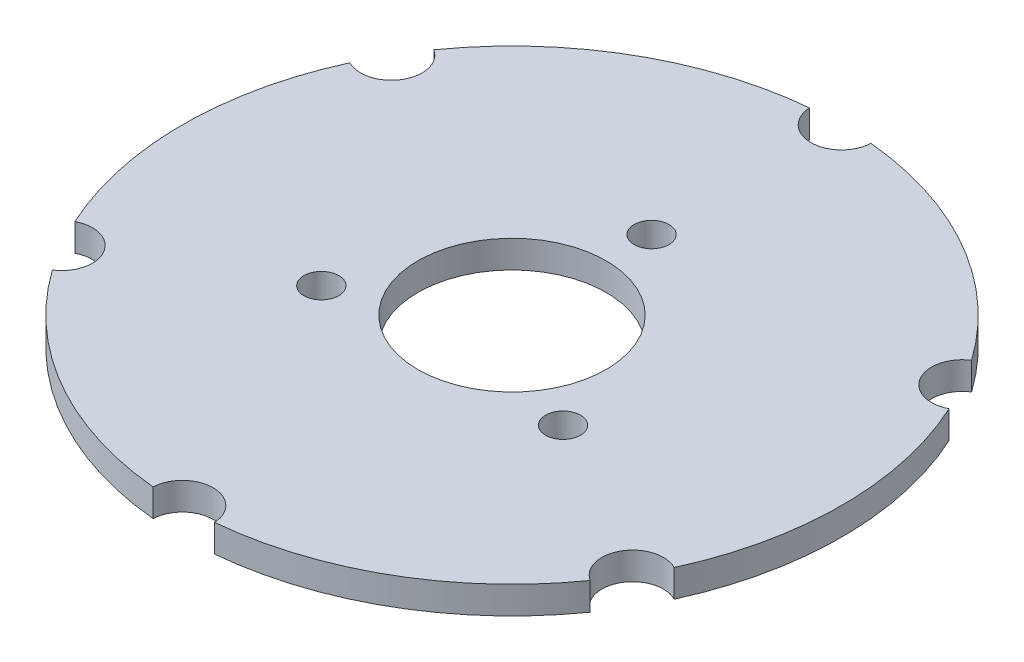
ISO-10303-21;
HEADER;
FILE_DESCRIPTION(('STEP AP214'),'2;1');
FILE_NAME('part.step','',(''),(''),'','','');
FILE_SCHEMA(('AUTOMOTIVE_DESIGN { 1 0 10303 214 1 1 1 1 }'));
ENDSEC;
DATA;
#1=APPLICATION_CONTEXT('core data for automotive mechanical design processes');
#2=APPLICATION_PROTOCOL_DEFINITION('international standard','automotive_design',2000,#1);
#3=PRODUCT_CONTEXT('',#1,'mechanical');
#4=PRODUCT('Part','Part','',(#3));
#5=PRODUCT_RELATED_PRODUCT_CATEGORY('part','',(#4));
#6=PRODUCT_DEFINITION_FORMATION('','',#4);
#7=PRODUCT_DEFINITION_CONTEXT('part definition',#1,'design');
#8=PRODUCT_DEFINITION('design','',#6,#7);
#9=PRODUCT_DEFINITION_SHAPE('','',#8);
#10=(LENGTH_UNIT() NAMED_UNIT(*) SI_UNIT(.MILLI.,.METRE.));
#11=(NAMED_UNIT(*) PLANE_ANGLE_UNIT() SI_UNIT($,.RADIAN.));
#12=(NAMED_UNIT(*) SI_UNIT($,.STERADIAN.) SOLID_ANGLE_UNIT());
#13=UNCERTAINTY_MEASURE_WITH_UNIT(LENGTH_MEASURE(1.E-05),#10,'distance_accuracy_value','');
#14=(GEOMETRIC_REPRESENTATION_CONTEXT(3) GLOBAL_UNCERTAINTY_ASSIGNED_CONTEXT((#13)) GLOBAL_UNIT_ASSIGNED_CONTEXT((#10,
#11,#12)) REPRESENTATION_CONTEXT('',''));
#15=CARTESIAN_POINT('',(0.,0.,0.));
#16=DIRECTION('',(0.,0.,1.));
#17=DIRECTION('',(1.,0.,0.));
#18=AXIS2_PLACEMENT_3D('',#15,#16,#17);
#19=CARTESIAN_POINT('',(0.,5.,0.));
#20=DIRECTION('',(0.,-1.,0.));
#21=DIRECTION('',(0.,0.,-1.));
#22=AXIS2_PLACEMENT_3D('',#19,#20,#21);
#23=CYLINDRICAL_SURFACE('',#22,59.99988);
#24=CARTESIAN_POINT('',(0.,0.,0.));
#25=DIRECTION('',(0.,1.,0.));
#26=DIRECTION('',(0.,0.,1.));
#27=AXIS2_PLACEMENT_3D('',#24,#25,#26);
#28=CIRCLE('',#27,59.99988);
#29=CARTESIAN_POINT('',(54.5318099850476,0.,25.0253331600013));
#30=VERTEX_POINT('',#29);
#31=CARTESIAN_POINT('',(54.5318099850471,0.,-25.0253331600024));
#32=VERTEX_POINT('',#31);
#33=EDGE_CURVE('E141',#30,#32,#28,.T.);
#34=ORIENTED_EDGE('',*,*,#33,.T.);
#35=DIRECTION('',(0.,1.,0.));
#36=VECTOR('',#35,1.);
#37=CARTESIAN_POINT('',(54.5318099850471,2.5,-25.0253331600024));
#38=LINE('',#37,#36);
#39=CARTESIAN_POINT('',(54.5318099850471,5.,-25.0253331600024));
#40=VERTEX_POINT('',#39);
#41=EDGE_CURVE('E50',#32,#40,#38,.T.);
#42=ORIENTED_EDGE('',*,*,#41,.T.);
#43=CARTESIAN_POINT('',(0.,5.,0.));
#44=DIRECTION('',(0.,1.,0.));
#45=DIRECTION('',(0.,0.,1.));
#46=AXIS2_PLACEMENT_3D('',#43,#44,#45);
#47=CIRCLE('',#46,59.99988);
#48=CARTESIAN_POINT('',(54.5318099850476,5.,25.0253331600013));
#49=VERTEX_POINT('',#48);
#50=EDGE_CURVE('E200',#49,#40,#47,.T.);
#51=ORIENTED_EDGE('',*,*,#50,.F.);
#52=DIRECTION('',(0.,1.,0.));
#53=VECTOR('',#52,1.);
#54=CARTESIAN_POINT('',(54.5318099850476,2.5,25.0253331600013));
#55=LINE('',#54,#53);
#56=EDGE_CURVE('E239',#49,#30,#55,.F.);
#57=ORIENTED_EDGE('',*,*,#56,.T.);
#58=EDGE_LOOP('',(#34,#42,#51,#57));
#59=FACE_BOUND('',#58,.T.);
#60=ADVANCED_FACE('F35',(#59),#23,.T.);
#61=CARTESIAN_POINT('',(5.59333073779304,0.,59.7385993413979));
#62=VERTEX_POINT('',#61);
#63=CARTESIAN_POINT('',(48.9384792472547,0.,34.7132661813956));
#64=VERTEX_POINT('',#63);
#65=EDGE_CURVE('E145',#62,#64,#28,.T.);
#66=ORIENTED_EDGE('',*,*,#65,.T.);
#67=DIRECTION('',(0.,1.,0.));
#68=VECTOR('',#67,1.);
#69=CARTESIAN_POINT('',(48.9384792472547,2.5,34.7132661813956));
#70=LINE('',#69,#68);
#71=CARTESIAN_POINT('',(48.9384792472547,5.,34.7132661813956));
#72=VERTEX_POINT('',#71);
#73=EDGE_CURVE('E57',#64,#72,#70,.T.);
#74=ORIENTED_EDGE('',*,*,#73,.T.);
#75=CARTESIAN_POINT('',(5.59333073779304,5.,59.7385993413979));
#76=VERTEX_POINT('',#75);
#77=EDGE_CURVE('E204',#76,#72,#47,.T.);
#78=ORIENTED_EDGE('',*,*,#77,.F.);
#79=DIRECTION('',(0.,1.,0.));
#80=VECTOR('',#79,1.);
#81=CARTESIAN_POINT('',(5.59333073779304,2.5,59.7385993413979));
#82=LINE('',#81,#80);
#83=EDGE_CURVE('E177',#76,#62,#82,.F.);
#84=ORIENTED_EDGE('',*,*,#83,.T.);
#85=EDGE_LOOP('',(#66,#74,#78,#84));
#86=FACE_BOUND('',#85,.T.);
#87=ADVANCED_FACE('F174',(#86),#23,.T.);
#88=CARTESIAN_POINT('',(-48.9384792472542,0.,34.7132661813963));
#89=VERTEX_POINT('',#88);
#90=CARTESIAN_POINT('',(-5.59333073779307,0.,59.7385993413979));
#91=VERTEX_POINT('',#90);
#92=EDGE_CURVE('E160',#89,#91,#28,.T.);
#93=ORIENTED_EDGE('',*,*,#92,.T.);
#94=DIRECTION('',(0.,1.,0.));
#95=VECTOR('',#94,1.);
#96=CARTESIAN_POINT('',(-5.59333073779304,2.5,59.7385993413979));
#97=LINE('',#96,#95);
#98=CARTESIAN_POINT('',(-5.59333073779304,5.,59.7385993413979));
#99=VERTEX_POINT('',#98);
#100=EDGE_CURVE('E233',#91,#99,#97,.T.);
#101=ORIENTED_EDGE('',*,*,#100,.T.);
#102=CARTESIAN_POINT('',(-48.9384792472542,5.,34.7132661813963));
#103=VERTEX_POINT('',#102);
#104=EDGE_CURVE('E197',#103,#99,#47,.T.);
#105=ORIENTED_EDGE('',*,*,#104,.F.);
#106=DIRECTION('',(0.,1.,0.));
#107=VECTOR('',#106,1.);
#108=CARTESIAN_POINT('',(-48.9384792472542,2.5,34.7132661813963));
#109=LINE('',#108,#107);
#110=EDGE_CURVE('E229',#103,#89,#109,.F.);
#111=ORIENTED_EDGE('',*,*,#110,.T.);
#112=EDGE_LOOP('',(#93,#101,#105,#111));
#113=FACE_BOUND('',#112,.T.);
#114=ADVANCED_FACE('F267',(#113),#23,.T.);
#115=CARTESIAN_POINT('',(-54.5318099850475,0.,-25.0253331600017));
#116=VERTEX_POINT('',#115);
#117=CARTESIAN_POINT('',(-54.5318099850473,0.,25.025333160002));
#118=VERTEX_POINT('',#117);
#119=EDGE_CURVE('E152',#116,#118,#28,.T.);
#120=ORIENTED_EDGE('',*,*,#119,.T.);
#121=DIRECTION('',(0.,1.,0.));
#122=VECTOR('',#121,1.);
#123=CARTESIAN_POINT('',(-54.5318099850473,2.5,25.025333160002));
#124=LINE('',#123,#122);
#125=CARTESIAN_POINT('',(-54.5318099850473,5.,25.025333160002));
#126=VERTEX_POINT('',#125);
#127=EDGE_CURVE('E227',#118,#126,#124,.T.);
#128=ORIENTED_EDGE('',*,*,#127,.T.);
#129=CARTESIAN_POINT('',(-54.5318099850475,5.,-25.0253331600017));
#130=VERTEX_POINT('',#129);
#131=EDGE_CURVE('E190',#130,#126,#47,.T.);
#132=ORIENTED_EDGE('',*,*,#131,.F.);
#133=DIRECTION('',(0.,1.,0.));
#134=VECTOR('',#133,1.);
#135=CARTESIAN_POINT('',(-54.5318099850475,2.5,-25.0253331600017));
#136=LINE('',#135,#134);
#137=EDGE_CURVE('E223',#130,#116,#136,.F.);
#138=ORIENTED_EDGE('',*,*,#137,.T.);
#139=EDGE_LOOP('',(#120,#128,#132,#138));
#140=FACE_BOUND('',#139,.T.);
#141=ADVANCED_FACE('F281',(#140),#23,.T.);
#142=CARTESIAN_POINT('',(-5.59333073779304,0.,-59.7385993413979));
#143=VERTEX_POINT('',#142);
#144=CARTESIAN_POINT('',(-48.9384792472544,0.,-34.713266181396));
#145=VERTEX_POINT('',#144);
#146=EDGE_CURVE('E144',#143,#145,#28,.T.);
#147=ORIENTED_EDGE('',*,*,#146,.T.);
#148=DIRECTION('',(0.,1.,0.));
#149=VECTOR('',#148,1.);
#150=CARTESIAN_POINT('',(-48.9384792472544,2.5,-34.7132661813959));
#151=LINE('',#150,#149);
#152=CARTESIAN_POINT('',(-48.9384792472544,5.,-34.7132661813959));
#153=VERTEX_POINT('',#152);
#154=EDGE_CURVE('E221',#145,#153,#151,.T.);
#155=ORIENTED_EDGE('',*,*,#154,.T.);
#156=CARTESIAN_POINT('',(-5.59333073779304,5.,-59.7385993413979));
#157=VERTEX_POINT('',#156);
#158=EDGE_CURVE('E188',#157,#153,#47,.T.);
#159=ORIENTED_EDGE('',*,*,#158,.F.);
#160=DIRECTION('',(0.,1.,0.));
#161=VECTOR('',#160,1.);
#162=CARTESIAN_POINT('',(-5.59333073779304,2.5,-59.7385993413979));
#163=LINE('',#162,#161);
#164=EDGE_CURVE('E217',#157,#143,#163,.F.);
#165=ORIENTED_EDGE('',*,*,#164,.T.);
#166=EDGE_LOOP('',(#147,#155,#159,#165));
#167=FACE_BOUND('',#166,.T.);
#168=ADVANCED_FACE('F271',(#167),#23,.T.);
#169=CARTESIAN_POINT('',(-21.9970452561248,5.,12.7));
#170=DIRECTION('',(0.,-1.,0.));
#171=DIRECTION('',(0.,0.,-1.));
#172=AXIS2_PLACEMENT_3D('',#169,#170,#171);
#173=CYLINDRICAL_SURFACE('',#172,3.175);
#174=CARTESIAN_POINT('',(-21.9970452561248,5.,12.7));
#175=DIRECTION('',(0.,1.,0.));
#176=DIRECTION('',(0.,0.,1.));
#177=AXIS2_PLACEMENT_3D('',#174,#175,#176);
#178=CIRCLE('',#177,3.175);
#179=CARTESIAN_POINT('',(-21.9970452561248,5.,15.875));
#180=VERTEX_POINT('',#179);
#181=EDGE_CURVE('E201',#180,#180,#178,.T.);
#182=ORIENTED_EDGE('',*,*,#181,.T.);
#183=EDGE_LOOP('',(#182));
#184=FACE_BOUND('',#183,.T.);
#185=CARTESIAN_POINT('',(-21.9970452561248,0.,12.7));
#186=DIRECTION('',(0.,1.,0.));
#187=DIRECTION('',(0.,0.,1.));
#188=AXIS2_PLACEMENT_3D('',#185,#186,#187);
#189=CIRCLE('',#188,3.175);
#190=CARTESIAN_POINT('',(-21.9970452561248,0.,15.875));
#191=VERTEX_POINT('',#190);
#192=EDGE_CURVE('E142',#191,#191,#189,.T.);
#193=ORIENTED_EDGE('',*,*,#192,.F.);
#194=EDGE_LOOP('',(#193));
#195=FACE_BOUND('',#194,.T.);
#196=ADVANCED_FACE('F280',(#184,#195),#173,.F.);
#197=CARTESIAN_POINT('',(0.,5.,-25.4));
#198=DIRECTION('',(0.,-1.,0.));
#199=DIRECTION('',(0.,0.,-1.));
#200=AXIS2_PLACEMENT_3D('',#197,#198,#199);
#201=CYLINDRICAL_SURFACE('',#200,3.175);
#202=CARTESIAN_POINT('',(0.,5.,-25.4));
#203=DIRECTION('',(0.,1.,0.));
#204=DIRECTION('',(0.,0.,1.));
#205=AXIS2_PLACEMENT_3D('',#202,#203,#204);
#206=CIRCLE('',#205,3.175);
#207=CARTESIAN_POINT('',(0.,5.,-22.225));
#208=VERTEX_POINT('',#207);
#209=EDGE_CURVE('E206',#208,#208,#206,.T.);
#210=ORIENTED_EDGE('',*,*,#209,.T.);
#211=EDGE_LOOP('',(#210));
#212=FACE_BOUND('',#211,.T.);
#213=CARTESIAN_POINT('',(0.,0.,-25.4));
#214=DIRECTION('',(0.,1.,0.));
#215=DIRECTION('',(0.,0.,1.));
#216=AXIS2_PLACEMENT_3D('',#213,#214,#215);
#217=CIRCLE('',#216,3.175);
#218=CARTESIAN_POINT('',(0.,0.,-22.225));
#219=VERTEX_POINT('',#218);
#220=EDGE_CURVE('E147',#219,#219,#217,.T.);
#221=ORIENTED_EDGE('',*,*,#220,.F.);
#222=EDGE_LOOP('',(#221));
#223=FACE_BOUND('',#222,.T.);
#224=ADVANCED_FACE('F286',(#212,#223),#201,.F.);
#225=CARTESIAN_POINT('',(21.9970452561248,5.,12.6999999999999));
#226=DIRECTION('',(0.,-1.,0.));
#227=DIRECTION('',(0.,0.,-1.));
#228=AXIS2_PLACEMENT_3D('',#225,#226,#227);
#229=CYLINDRICAL_SURFACE('',#228,3.175);
#230=CARTESIAN_POINT('',(21.9970452561248,5.,12.6999999999999));
#231=DIRECTION('',(0.,1.,0.));
#232=DIRECTION('',(0.,0.,1.));
#233=AXIS2_PLACEMENT_3D('',#230,#231,#232);
#234=CIRCLE('',#233,3.175);
#235=CARTESIAN_POINT('',(21.9970452561248,5.,15.8749999999999));
#236=VERTEX_POINT('',#235);
#237=EDGE_CURVE('E157',#236,#236,#234,.T.);
#238=ORIENTED_EDGE('',*,*,#237,.T.);
#239=EDGE_LOOP('',(#238));
#240=FACE_BOUND('',#239,.T.);
#241=CARTESIAN_POINT('',(21.9970452561248,0.,12.6999999999999));
#242=DIRECTION('',(0.,1.,0.));
#243=DIRECTION('',(0.,0.,1.));
#244=AXIS2_PLACEMENT_3D('',#241,#242,#243);
#245=CIRCLE('',#244,3.175);
#246=CARTESIAN_POINT('',(21.9970452561248,0.,15.8749999999999));
#247=VERTEX_POINT('',#246);
#248=EDGE_CURVE('E355',#247,#247,#245,.T.);
#249=ORIENTED_EDGE('',*,*,#248,.F.);
#250=EDGE_LOOP('',(#249));
#251=FACE_BOUND('',#250,.T.);
#252=ADVANCED_FACE('F277',(#240,#251),#229,.F.);
#253=CARTESIAN_POINT('',(0.,5.,0.));
#254=DIRECTION('',(0.,-1.,0.));
#255=DIRECTION('',(0.,0.,-1.));
#256=AXIS2_PLACEMENT_3D('',#253,#254,#255);
#257=CYLINDRICAL_SURFACE('',#256,17.145);
#258=CARTESIAN_POINT('',(0.,5.,0.));
#259=DIRECTION('',(0.,1.,0.));
#260=DIRECTION('',(0.,0.,1.));
#261=AXIS2_PLACEMENT_3D('',#258,#259,#260);
#262=CIRCLE('',#261,17.145);
#263=CARTESIAN_POINT('',(0.,5.,17.145));
#264=VERTEX_POINT('',#263);
#265=EDGE_CURVE('E151',#264,#264,#262,.T.);
#266=ORIENTED_EDGE('',*,*,#265,.T.);
#267=EDGE_LOOP('',(#266));
#268=FACE_BOUND('',#267,.T.);
#269=CARTESIAN_POINT('',(0.,0.,0.));
#270=DIRECTION('',(0.,1.,0.));
#271=DIRECTION('',(0.,0.,1.));
#272=AXIS2_PLACEMENT_3D('',#269,#270,#271);
#273=CIRCLE('',#272,17.145);
#274=CARTESIAN_POINT('',(0.,0.,17.145));
#275=VERTEX_POINT('',#274);
#276=EDGE_CURVE('E216',#275,#275,#273,.T.);
#277=ORIENTED_EDGE('',*,*,#276,.F.);
#278=EDGE_LOOP('',(#277));
#279=FACE_BOUND('',#278,.T.);
#280=ADVANCED_FACE('F37',(#268,#279),#257,.F.);
#281=CARTESIAN_POINT('',(48.938479247254,5.,-34.7132661813966));
#282=VERTEX_POINT('',#281);
#283=CARTESIAN_POINT('',(5.59333073779304,5.,-59.7385993413979));
#284=VERTEX_POINT('',#283);
#285=EDGE_CURVE('E134',#282,#284,#47,.T.);
#286=ORIENTED_EDGE('',*,*,#285,.F.);
#287=DIRECTION('',(0.,1.,0.));
#288=VECTOR('',#287,1.);
#289=CARTESIAN_POINT('',(48.938479247254,2.5,-34.7132661813966));
#290=LINE('',#289,#288);
#291=CARTESIAN_POINT('',(48.938479247254,0.,-34.7132661813966));
#292=VERTEX_POINT('',#291);
#293=EDGE_CURVE('E122',#282,#292,#290,.F.);
#294=ORIENTED_EDGE('',*,*,#293,.T.);
#295=CARTESIAN_POINT('',(5.59333073779307,0.,-59.7385993413979));
#296=VERTEX_POINT('',#295);
#297=EDGE_CURVE('E132',#292,#296,#28,.T.);
#298=ORIENTED_EDGE('',*,*,#297,.T.);
#299=DIRECTION('',(0.,1.,0.));
#300=VECTOR('',#299,1.);
#301=CARTESIAN_POINT('',(5.59333073779304,2.5,-59.7385993413979));
#302=LINE('',#301,#300);
#303=EDGE_CURVE('E214',#296,#284,#302,.T.);
#304=ORIENTED_EDGE('',*,*,#303,.T.);
#305=EDGE_LOOP('',(#286,#294,#298,#304));
#306=FACE_BOUND('',#305,.T.);
#307=ADVANCED_FACE('F130',(#306),#23,.T.);
#308=CARTESIAN_POINT('',(-132.141157356237,5.,0.));
#309=DIRECTION('',(0.,1.,0.));
#310=DIRECTION('',(0.,0.,1.));
#311=AXIS2_PLACEMENT_3D('',#308,#309,#310);
#312=PLANE('',#311);
#313=CARTESIAN_POINT('',(51.9614203040175,5.,-29.9999400000006));
#314=DIRECTION('',(0.,1.,0.));
#315=DIRECTION('',(-0.866025403784433,0.,0.50000000000001));
#316=AXIS2_PLACEMENT_3D('',#313,#314,#315);
#317=CIRCLE('',#316,5.59943);
#318=EDGE_CURVE('E135',#282,#40,#317,.T.);
#319=ORIENTED_EDGE('',*,*,#318,.F.);
#320=ORIENTED_EDGE('',*,*,#285,.T.);
#321=CARTESIAN_POINT('',(0.,5.,-59.99988));
#322=DIRECTION('',(0.,1.,0.));
#323=DIRECTION('',(0.,0.,1.));
#324=AXIS2_PLACEMENT_3D('',#321,#322,#323);
#325=CIRCLE('',#324,5.59943);
#326=EDGE_CURVE('E219',#157,#284,#325,.T.);
#327=ORIENTED_EDGE('',*,*,#326,.F.);
#328=ORIENTED_EDGE('',*,*,#158,.T.);
#329=CARTESIAN_POINT('',(-51.9614203040179,5.,-29.9999399999999));
#330=DIRECTION('',(0.,1.,0.));
#331=DIRECTION('',(0.86602540378444,0.,0.499999999999998));
#332=AXIS2_PLACEMENT_3D('',#329,#330,#331);
#333=CIRCLE('',#332,5.59943);
#334=EDGE_CURVE('E225',#130,#153,#333,.T.);
#335=ORIENTED_EDGE('',*,*,#334,.F.);
#336=ORIENTED_EDGE('',*,*,#131,.T.);
#337=CARTESIAN_POINT('',(-51.9614203040177,5.,29.9999400000002));
#338=DIRECTION('',(0.,1.,0.));
#339=DIRECTION('',(0.866025403784436,0.,-0.500000000000004));
#340=AXIS2_PLACEMENT_3D('',#337,#338,#339);
#341=CIRCLE('',#340,5.59943);
#342=EDGE_CURVE('E231',#103,#126,#341,.T.);
#343=ORIENTED_EDGE('',*,*,#342,.F.);
#344=ORIENTED_EDGE('',*,*,#104,.T.);
#345=CARTESIAN_POINT('',(0.,5.,59.99988));
#346=DIRECTION('',(0.,1.,0.));
#347=DIRECTION('',(0.,0.,-1.));
#348=AXIS2_PLACEMENT_3D('',#345,#346,#347);
#349=CIRCLE('',#348,5.59943);
#350=EDGE_CURVE('E236',#76,#99,#349,.T.);
#351=ORIENTED_EDGE('',*,*,#350,.F.);
#352=ORIENTED_EDGE('',*,*,#77,.T.);
#353=CARTESIAN_POINT('',(51.9614203040181,5.,29.9999399999995));
#354=DIRECTION('',(0.,1.,0.));
#355=DIRECTION('',(-0.866025403784443,0.,-0.499999999999992));
#356=AXIS2_PLACEMENT_3D('',#353,#354,#355);
#357=CIRCLE('',#356,5.59943);
#358=EDGE_CURVE('E241',#49,#72,#357,.T.);
#359=ORIENTED_EDGE('',*,*,#358,.F.);
#360=ORIENTED_EDGE('',*,*,#50,.T.);
#361=EDGE_LOOP('',(#319,#320,#327,#328,#335,#336,#343,#344,#351,#352,#359,#360));
#362=FACE_BOUND('',#361,.T.);
#363=ORIENTED_EDGE('',*,*,#265,.F.);
#364=EDGE_LOOP('',(#363));
#365=FACE_BOUND('',#364,.T.);
#366=ORIENTED_EDGE('',*,*,#237,.F.);
#367=EDGE_LOOP('',(#366));
#368=FACE_BOUND('',#367,.T.);
#369=ORIENTED_EDGE('',*,*,#209,.F.);
#370=EDGE_LOOP('',(#369));
#371=FACE_BOUND('',#370,.T.);
#372=ORIENTED_EDGE('',*,*,#181,.F.);
#373=EDGE_LOOP('',(#372));
#374=FACE_BOUND('',#373,.T.);
#375=ADVANCED_FACE('F247',(#362,#365,#368,#371,#374),#312,.T.);
#376=CARTESIAN_POINT('',(-132.141157356237,0.,0.));
#377=DIRECTION('',(0.,1.,0.));
#378=DIRECTION('',(0.,0.,1.));
#379=AXIS2_PLACEMENT_3D('',#376,#377,#378);
#380=PLANE('',#379);
#381=ORIENTED_EDGE('',*,*,#276,.T.);
#382=EDGE_LOOP('',(#381));
#383=FACE_BOUND('',#382,.T.);
#384=ORIENTED_EDGE('',*,*,#248,.T.);
#385=EDGE_LOOP('',(#384));
#386=FACE_BOUND('',#385,.T.);
#387=ORIENTED_EDGE('',*,*,#220,.T.);
#388=EDGE_LOOP('',(#387));
#389=FACE_BOUND('',#388,.T.);
#390=ORIENTED_EDGE('',*,*,#192,.T.);
#391=EDGE_LOOP('',(#390));
#392=FACE_BOUND('',#391,.T.);
#393=ORIENTED_EDGE('',*,*,#297,.F.);
#394=CARTESIAN_POINT('',(51.9614203040175,0.,-29.9999400000006));
#395=DIRECTION('',(0.,1.,0.));
#396=DIRECTION('',(0.,0.,1.));
#397=AXIS2_PLACEMENT_3D('',#394,#395,#396);
#398=CIRCLE('',#397,5.59943);
#399=EDGE_CURVE('E11',#292,#32,#398,.T.);
#400=ORIENTED_EDGE('',*,*,#399,.T.);
#401=ORIENTED_EDGE('',*,*,#33,.F.);
#402=CARTESIAN_POINT('',(51.9614203040181,0.,29.9999399999995));
#403=DIRECTION('',(0.,1.,0.));
#404=DIRECTION('',(0.,0.,1.));
#405=AXIS2_PLACEMENT_3D('',#402,#403,#404);
#406=CIRCLE('',#405,5.59943);
#407=EDGE_CURVE('E43',#30,#64,#406,.T.);
#408=ORIENTED_EDGE('',*,*,#407,.T.);
#409=ORIENTED_EDGE('',*,*,#65,.F.);
#410=CARTESIAN_POINT('',(0.,0.,59.99988));
#411=DIRECTION('',(0.,1.,0.));
#412=DIRECTION('',(0.,0.,1.));
#413=AXIS2_PLACEMENT_3D('',#410,#411,#412);
#414=CIRCLE('',#413,5.59943);
#415=EDGE_CURVE('E179',#62,#91,#414,.T.);
#416=ORIENTED_EDGE('',*,*,#415,.T.);
#417=ORIENTED_EDGE('',*,*,#92,.F.);
#418=CARTESIAN_POINT('',(-51.9614203040177,0.,29.9999400000002));
#419=DIRECTION('',(0.,1.,0.));
#420=DIRECTION('',(0.,0.,1.));
#421=AXIS2_PLACEMENT_3D('',#418,#419,#420);
#422=CIRCLE('',#421,5.59943);
#423=EDGE_CURVE('E181',#89,#118,#422,.T.);
#424=ORIENTED_EDGE('',*,*,#423,.T.);
#425=ORIENTED_EDGE('',*,*,#119,.F.);
#426=CARTESIAN_POINT('',(-51.9614203040179,0.,-29.9999399999999));
#427=DIRECTION('',(0.,1.,0.));
#428=DIRECTION('',(0.,0.,1.));
#429=AXIS2_PLACEMENT_3D('',#426,#427,#428);
#430=CIRCLE('',#429,5.59943);
#431=EDGE_CURVE('E186',#116,#145,#430,.T.);
#432=ORIENTED_EDGE('',*,*,#431,.T.);
#433=ORIENTED_EDGE('',*,*,#146,.F.);
#434=CARTESIAN_POINT('',(0.,0.,-59.99988));
#435=DIRECTION('',(0.,1.,0.));
#436=DIRECTION('',(0.,0.,1.));
#437=AXIS2_PLACEMENT_3D('',#434,#435,#436);
#438=CIRCLE('',#437,5.59943);
#439=EDGE_CURVE('E140',#143,#296,#438,.T.);
#440=ORIENTED_EDGE('',*,*,#439,.T.);
#441=EDGE_LOOP('',(#393,#400,#401,#408,#409,#416,#417,#424,#425,#432,#433,#440));
#442=FACE_BOUND('',#441,.T.);
#443=ADVANCED_FACE('F138',(#383,#386,#389,#392,#442),#380,.F.);
#444=CARTESIAN_POINT('',(0.,0.,-59.99988));
#445=DIRECTION('',(0.,1.,0.));
#446=DIRECTION('',(0.,0.,1.));
#447=AXIS2_PLACEMENT_3D('',#444,#445,#446);
#448=CYLINDRICAL_SURFACE('',#447,5.59943);
#449=ORIENTED_EDGE('',*,*,#439,.F.);
#450=ORIENTED_EDGE('',*,*,#164,.F.);
#451=ORIENTED_EDGE('',*,*,#326,.T.);
#452=ORIENTED_EDGE('',*,*,#303,.F.);
#453=EDGE_LOOP('',(#449,#450,#451,#452));
#454=FACE_BOUND('',#453,.T.);
#455=ADVANCED_FACE('F306',(#454),#448,.F.);
#456=CARTESIAN_POINT('',(-51.9614203040179,0.,-29.9999399999999));
#457=DIRECTION('',(0.,1.,0.));
#458=DIRECTION('',(0.,0.,1.));
#459=AXIS2_PLACEMENT_3D('',#456,#457,#458);
#460=CYLINDRICAL_SURFACE('',#459,5.59943);
#461=ORIENTED_EDGE('',*,*,#431,.F.);
#462=ORIENTED_EDGE('',*,*,#137,.F.);
#463=ORIENTED_EDGE('',*,*,#334,.T.);
#464=ORIENTED_EDGE('',*,*,#154,.F.);
#465=EDGE_LOOP('',(#461,#462,#463,#464));
#466=FACE_BOUND('',#465,.T.);
#467=ADVANCED_FACE('F311',(#466),#460,.F.);
#468=CARTESIAN_POINT('',(-51.9614203040177,0.,29.9999400000002));
#469=DIRECTION('',(0.,1.,0.));
#470=DIRECTION('',(0.,0.,1.));
#471=AXIS2_PLACEMENT_3D('',#468,#469,#470);
#472=CYLINDRICAL_SURFACE('',#471,5.59943);
#473=ORIENTED_EDGE('',*,*,#423,.F.);
#474=ORIENTED_EDGE('',*,*,#110,.F.);
#475=ORIENTED_EDGE('',*,*,#342,.T.);
#476=ORIENTED_EDGE('',*,*,#127,.F.);
#477=EDGE_LOOP('',(#473,#474,#475,#476));
#478=FACE_BOUND('',#477,.T.);
#479=ADVANCED_FACE('F259',(#478),#472,.F.);
#480=CARTESIAN_POINT('',(0.,0.,59.99988));
#481=DIRECTION('',(0.,1.,0.));
#482=DIRECTION('',(0.,0.,1.));
#483=AXIS2_PLACEMENT_3D('',#480,#481,#482);
#484=CYLINDRICAL_SURFACE('',#483,5.59943);
#485=ORIENTED_EDGE('',*,*,#415,.F.);
#486=ORIENTED_EDGE('',*,*,#83,.F.);
#487=ORIENTED_EDGE('',*,*,#350,.T.);
#488=ORIENTED_EDGE('',*,*,#100,.F.);
#489=EDGE_LOOP('',(#485,#486,#487,#488));
#490=FACE_BOUND('',#489,.T.);
#491=ADVANCED_FACE('F252',(#490),#484,.F.);
#492=CARTESIAN_POINT('',(51.9614203040181,0.,29.9999399999995));
#493=DIRECTION('',(0.,1.,0.));
#494=DIRECTION('',(0.,0.,1.));
#495=AXIS2_PLACEMENT_3D('',#492,#493,#494);
#496=CYLINDRICAL_SURFACE('',#495,5.59943);
#497=ORIENTED_EDGE('',*,*,#407,.F.);
#498=ORIENTED_EDGE('',*,*,#56,.F.);
#499=ORIENTED_EDGE('',*,*,#358,.T.);
#500=ORIENTED_EDGE('',*,*,#73,.F.);
#501=EDGE_LOOP('',(#497,#498,#499,#500));
#502=FACE_BOUND('',#501,.T.);
#503=ADVANCED_FACE('F250',(#502),#496,.F.);
#504=CARTESIAN_POINT('',(51.9614203040175,0.,-29.9999400000006));
#505=DIRECTION('',(0.,1.,0.));
#506=DIRECTION('',(0.,0.,1.));
#507=AXIS2_PLACEMENT_3D('',#504,#505,#506);
#508=CYLINDRICAL_SURFACE('',#507,5.59943);
#509=ORIENTED_EDGE('',*,*,#399,.F.);
#510=ORIENTED_EDGE('',*,*,#293,.F.);
#511=ORIENTED_EDGE('',*,*,#318,.T.);
#512=ORIENTED_EDGE('',*,*,#41,.F.);
#513=EDGE_LOOP('',(#509,#510,#511,#512));
#514=FACE_BOUND('',#513,.T.);
#515=ADVANCED_FACE('F121',(#514),#508,.F.);
#516=CLOSED_SHELL('',(#60,#87,#114,#141,#168,#196,#224,#252,#280,#307,#375,#443,#455,#467,#479,
#491,#503,#515));
#517=MANIFOLD_SOLID_BREP('B2',#516);
#518=ADVANCED_BREP_SHAPE_REPRESENTATION('',(#18,#517),#14);
#519=SHAPE_DEFINITION_REPRESENTATION(#9,#518);
ENDSEC;
END-ISO-10303-21;
